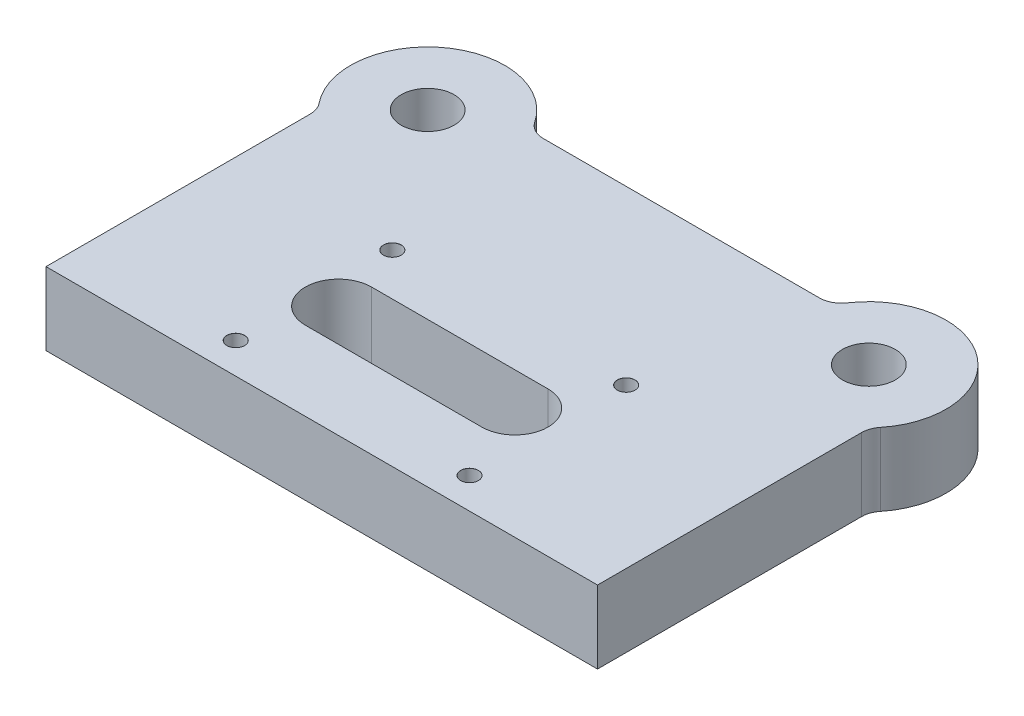
ISO-10303-21;
HEADER;
FILE_DESCRIPTION(('STEP AP214'),'2;1');
FILE_NAME('part.step','',(''),(''),'','','');
FILE_SCHEMA(('AUTOMOTIVE_DESIGN { 1 0 10303 214 1 1 1 1 }'));
ENDSEC;
DATA;
#1=APPLICATION_CONTEXT('core data for automotive mechanical design processes');
#2=APPLICATION_PROTOCOL_DEFINITION('international standard','automotive_design',2000,#1);
#3=PRODUCT_CONTEXT('',#1,'mechanical');
#4=PRODUCT('Part','Part','',(#3));
#5=PRODUCT_RELATED_PRODUCT_CATEGORY('part','',(#4));
#6=PRODUCT_DEFINITION_FORMATION('','',#4);
#7=PRODUCT_DEFINITION_CONTEXT('part definition',#1,'design');
#8=PRODUCT_DEFINITION('design','',#6,#7);
#9=PRODUCT_DEFINITION_SHAPE('','',#8);
#10=(LENGTH_UNIT() NAMED_UNIT(*) SI_UNIT(.MILLI.,.METRE.));
#11=(NAMED_UNIT(*) PLANE_ANGLE_UNIT() SI_UNIT($,.RADIAN.));
#12=(NAMED_UNIT(*) SI_UNIT($,.STERADIAN.) SOLID_ANGLE_UNIT());
#13=UNCERTAINTY_MEASURE_WITH_UNIT(LENGTH_MEASURE(1.E-05),#10,'distance_accuracy_value','');
#14=(GEOMETRIC_REPRESENTATION_CONTEXT(3) GLOBAL_UNCERTAINTY_ASSIGNED_CONTEXT((#13)) GLOBAL_UNIT_ASSIGNED_CONTEXT((#10,
#11,#12)) REPRESENTATION_CONTEXT('',''));
#15=CARTESIAN_POINT('',(0.,0.,0.));
#16=DIRECTION('',(0.,0.,1.));
#17=DIRECTION('',(1.,0.,0.));
#18=AXIS2_PLACEMENT_3D('',#15,#16,#17);
#19=CARTESIAN_POINT('',(-100.,33.,-148.));
#20=DIRECTION('',(0.,1.,0.));
#21=DIRECTION('',(0.,0.,1.));
#22=AXIS2_PLACEMENT_3D('',#19,#20,#21);
#23=PLANE('',#22);
#24=CARTESIAN_POINT('',(-43.2169471824198,33.,-50.7720841198368));
#25=DIRECTION('',(0.,1.,0.));
#26=DIRECTION('',(0.,0.,1.));
#27=AXIS2_PLACEMENT_3D('',#24,#25,#26);
#28=CIRCLE('',#27,15.);
#29=CARTESIAN_POINT('',(-43.2169471824198,33.,-65.7720841198368));
#30=VERTEX_POINT('',#29);
#31=CARTESIAN_POINT('',(-43.2169471824198,33.,-35.7720841198368));
#32=VERTEX_POINT('',#31);
#33=EDGE_CURVE('E48',#30,#32,#28,.T.);
#34=ORIENTED_EDGE('',*,*,#33,.F.);
#35=DIRECTION('',(-1.,0.,0.));
#36=VECTOR('',#35,1.);
#37=CARTESIAN_POINT('',(-43.2169471824198,33.,-65.7720841198368));
#38=LINE('',#37,#36);
#39=CARTESIAN_POINT('',(36.7830528175802,33.,-65.7720841198368));
#40=VERTEX_POINT('',#39);
#41=EDGE_CURVE('E141',#40,#30,#38,.T.);
#42=ORIENTED_EDGE('',*,*,#41,.F.);
#43=CARTESIAN_POINT('',(36.7830528175802,33.,-50.7720841198368));
#44=DIRECTION('',(0.,1.,0.));
#45=DIRECTION('',(0.,0.,1.));
#46=AXIS2_PLACEMENT_3D('',#43,#44,#45);
#47=CIRCLE('',#46,15.);
#48=CARTESIAN_POINT('',(36.7830528175802,33.,-35.7720841198368));
#49=VERTEX_POINT('',#48);
#50=EDGE_CURVE('E161',#49,#40,#47,.T.);
#51=ORIENTED_EDGE('',*,*,#50,.F.);
#52=DIRECTION('',(1.,0.,0.));
#53=VECTOR('',#52,1.);
#54=CARTESIAN_POINT('',(-43.2169471824198,33.,-35.7720841198368));
#55=LINE('',#54,#53);
#56=EDGE_CURVE('E155',#32,#49,#55,.T.);
#57=ORIENTED_EDGE('',*,*,#56,.F.);
#58=EDGE_LOOP('',(#34,#42,#51,#57));
#59=FACE_BOUND('',#58,.T.);
#60=CARTESIAN_POINT('',(-53.,33.,-85.));
#61=DIRECTION('',(0.,1.,0.));
#62=DIRECTION('',(0.,0.,1.));
#63=AXIS2_PLACEMENT_3D('',#60,#61,#62);
#64=CIRCLE('',#63,4.025);
#65=CARTESIAN_POINT('',(-53.,33.,-80.975));
#66=VERTEX_POINT('',#65);
#67=EDGE_CURVE('E147',#66,#66,#64,.T.);
#68=ORIENTED_EDGE('',*,*,#67,.F.);
#69=EDGE_LOOP('',(#68));
#70=FACE_BOUND('',#69,.T.);
#71=CARTESIAN_POINT('',(53.,33.,-85.));
#72=DIRECTION('',(0.,1.,0.));
#73=DIRECTION('',(0.,0.,1.));
#74=AXIS2_PLACEMENT_3D('',#71,#72,#73);
#75=CIRCLE('',#74,4.025);
#76=CARTESIAN_POINT('',(53.,33.,-80.975));
#77=VERTEX_POINT('',#76);
#78=EDGE_CURVE('E178',#77,#77,#75,.T.);
#79=ORIENTED_EDGE('',*,*,#78,.F.);
#80=EDGE_LOOP('',(#79));
#81=FACE_BOUND('',#80,.T.);
#82=CARTESIAN_POINT('',(53.,33.,-14.));
#83=DIRECTION('',(0.,1.,0.));
#84=DIRECTION('',(0.,0.,1.));
#85=AXIS2_PLACEMENT_3D('',#82,#83,#84);
#86=CIRCLE('',#85,4.025);
#87=CARTESIAN_POINT('',(53.,33.,-9.97499999999997));
#88=VERTEX_POINT('',#87);
#89=EDGE_CURVE('E187',#88,#88,#86,.T.);
#90=ORIENTED_EDGE('',*,*,#89,.F.);
#91=EDGE_LOOP('',(#90));
#92=FACE_BOUND('',#91,.T.);
#93=CARTESIAN_POINT('',(-53.,33.,-14.));
#94=DIRECTION('',(0.,1.,0.));
#95=DIRECTION('',(0.,0.,1.));
#96=AXIS2_PLACEMENT_3D('',#93,#94,#95);
#97=CIRCLE('',#96,4.025);
#98=CARTESIAN_POINT('',(-53.,33.,-9.97499999999997));
#99=VERTEX_POINT('',#98);
#100=EDGE_CURVE('E196',#99,#99,#97,.T.);
#101=ORIENTED_EDGE('',*,*,#100,.F.);
#102=EDGE_LOOP('',(#101));
#103=FACE_BOUND('',#102,.T.);
#104=CARTESIAN_POINT('',(-100.,33.,-148.));
#105=DIRECTION('',(0.,1.,0.));
#106=DIRECTION('',(0.,0.,1.));
#107=AXIS2_PLACEMENT_3D('',#104,#105,#106);
#108=CIRCLE('',#107,12.);
#109=CARTESIAN_POINT('',(-100.,33.,-136.));
#110=VERTEX_POINT('',#109);
#111=EDGE_CURVE('E212',#110,#110,#108,.T.);
#112=ORIENTED_EDGE('',*,*,#111,.F.);
#113=EDGE_LOOP('',(#112));
#114=FACE_BOUND('',#113,.T.);
#115=CARTESIAN_POINT('',(-100.,33.,-148.));
#116=DIRECTION('',(0.,1.,0.));
#117=DIRECTION('',(0.,0.,1.));
#118=AXIS2_PLACEMENT_3D('',#115,#116,#117);
#119=CIRCLE('',#118,35.);
#120=CARTESIAN_POINT('',(-70.8982203250916,33.,-167.444444444444));
#121=VERTEX_POINT('',#120);
#122=CARTESIAN_POINT('',(-127.222222222222,33.,-126.001122363085));
#123=VERTEX_POINT('',#122);
#124=EDGE_CURVE('E232',#121,#123,#119,.T.);
#125=ORIENTED_EDGE('',*,*,#124,.T.);
#126=CARTESIAN_POINT('',(-135.,33.,-119.715728752538));
#127=DIRECTION('',(0.,1.,0.));
#128=DIRECTION('',(0.,0.,1.));
#129=AXIS2_PLACEMENT_3D('',#126,#127,#128);
#130=CIRCLE('',#129,10.);
#131=CARTESIAN_POINT('',(-125.,33.,-119.715728752538));
#132=VERTEX_POINT('',#131);
#133=EDGE_CURVE('E11',#123,#132,#130,.F.);
#134=ORIENTED_EDGE('',*,*,#133,.T.);
#135=DIRECTION('',(0.,0.,1.));
#136=VECTOR('',#135,1.);
#137=CARTESIAN_POINT('',(-125.,33.,0.));
#138=LINE('',#137,#136);
#139=CARTESIAN_POINT('',(-125.,33.,0.));
#140=VERTEX_POINT('',#139);
#141=EDGE_CURVE('E218',#132,#140,#138,.T.);
#142=ORIENTED_EDGE('',*,*,#141,.T.);
#143=DIRECTION('',(1.,0.,0.));
#144=VECTOR('',#143,1.);
#145=CARTESIAN_POINT('',(125.,33.,0.));
#146=LINE('',#145,#144);
#147=CARTESIAN_POINT('',(125.,33.,0.));
#148=VERTEX_POINT('',#147);
#149=EDGE_CURVE('E220',#140,#148,#146,.T.);
#150=ORIENTED_EDGE('',*,*,#149,.T.);
#151=DIRECTION('',(0.,0.,-1.));
#152=VECTOR('',#151,1.);
#153=CARTESIAN_POINT('',(125.,33.,0.));
#154=LINE('',#153,#152);
#155=CARTESIAN_POINT('',(125.,33.,-119.715728752538));
#156=VERTEX_POINT('',#155);
#157=EDGE_CURVE('E223',#148,#156,#154,.T.);
#158=ORIENTED_EDGE('',*,*,#157,.T.);
#159=CARTESIAN_POINT('',(135.,33.,-119.715728752538));
#160=DIRECTION('',(0.,1.,0.));
#161=DIRECTION('',(0.,0.,1.));
#162=AXIS2_PLACEMENT_3D('',#159,#160,#161);
#163=CIRCLE('',#162,10.);
#164=CARTESIAN_POINT('',(127.222222222222,33.,-126.001122363085));
#165=VERTEX_POINT('',#164);
#166=EDGE_CURVE('E277',#156,#165,#163,.F.);
#167=ORIENTED_EDGE('',*,*,#166,.T.);
#168=CARTESIAN_POINT('',(100.,33.,-148.));
#169=DIRECTION('',(0.,1.,0.));
#170=DIRECTION('',(0.,0.,-1.));
#171=AXIS2_PLACEMENT_3D('',#168,#169,#170);
#172=CIRCLE('',#171,35.);
#173=CARTESIAN_POINT('',(70.8982203250916,33.,-167.444444444444));
#174=VERTEX_POINT('',#173);
#175=EDGE_CURVE('E226',#165,#174,#172,.T.);
#176=ORIENTED_EDGE('',*,*,#175,.T.);
#177=CARTESIAN_POINT('',(62.5834261322606,33.,-173.));
#178=DIRECTION('',(0.,1.,0.));
#179=DIRECTION('',(0.,0.,1.));
#180=AXIS2_PLACEMENT_3D('',#177,#178,#179);
#181=CIRCLE('',#180,10.);
#182=CARTESIAN_POINT('',(62.5834261322606,33.,-163.));
#183=VERTEX_POINT('',#182);
#184=EDGE_CURVE('E281',#174,#183,#181,.F.);
#185=ORIENTED_EDGE('',*,*,#184,.T.);
#186=DIRECTION('',(-1.,0.,0.));
#187=VECTOR('',#186,1.);
#188=CARTESIAN_POINT('',(68.3772233983162,33.,-163.));
#189=LINE('',#188,#187);
#190=CARTESIAN_POINT('',(-62.5834261322606,33.,-163.));
#191=VERTEX_POINT('',#190);
#192=EDGE_CURVE('E229',#183,#191,#189,.T.);
#193=ORIENTED_EDGE('',*,*,#192,.T.);
#194=CARTESIAN_POINT('',(-62.5834261322606,33.,-173.));
#195=DIRECTION('',(0.,1.,0.));
#196=DIRECTION('',(0.,0.,1.));
#197=AXIS2_PLACEMENT_3D('',#194,#195,#196);
#198=CIRCLE('',#197,10.);
#199=EDGE_CURVE('E285',#191,#121,#198,.F.);
#200=ORIENTED_EDGE('',*,*,#199,.T.);
#201=EDGE_LOOP('',(#125,#134,#142,#150,#158,#167,#176,#185,#193,#200));
#202=FACE_BOUND('',#201,.T.);
#203=CARTESIAN_POINT('',(100.,33.,-148.));
#204=DIRECTION('',(0.,1.,0.));
#205=DIRECTION('',(0.,0.,-1.));
#206=AXIS2_PLACEMENT_3D('',#203,#204,#205);
#207=CIRCLE('',#206,12.);
#208=CARTESIAN_POINT('',(100.,33.,-160.));
#209=VERTEX_POINT('',#208);
#210=EDGE_CURVE('E206',#209,#209,#207,.T.);
#211=ORIENTED_EDGE('',*,*,#210,.F.);
#212=EDGE_LOOP('',(#211));
#213=FACE_BOUND('',#212,.T.);
#214=ADVANCED_FACE('F33',(#59,#70,#81,#92,#103,#114,#202,#213),#23,.T.);
#215=CARTESIAN_POINT('',(-100.,0.,-148.));
#216=DIRECTION('',(0.,1.,0.));
#217=DIRECTION('',(0.,0.,1.));
#218=AXIS2_PLACEMENT_3D('',#215,#216,#217);
#219=PLANE('',#218);
#220=DIRECTION('',(1.,0.,0.));
#221=VECTOR('',#220,1.);
#222=CARTESIAN_POINT('',(-43.2169471824198,0.,-65.7720841198368));
#223=LINE('',#222,#221);
#224=CARTESIAN_POINT('',(-43.2169471824198,0.,-65.7720841198368));
#225=VERTEX_POINT('',#224);
#226=CARTESIAN_POINT('',(36.7830528175802,0.,-65.7720841198368));
#227=VERTEX_POINT('',#226);
#228=EDGE_CURVE('E153',#225,#227,#223,.T.);
#229=ORIENTED_EDGE('',*,*,#228,.F.);
#230=CARTESIAN_POINT('',(-43.2169471824198,0.,-50.7720841198368));
#231=DIRECTION('',(0.,1.,0.));
#232=DIRECTION('',(0.,0.,1.));
#233=AXIS2_PLACEMENT_3D('',#230,#231,#232);
#234=CIRCLE('',#233,15.);
#235=CARTESIAN_POINT('',(-43.2169471824198,0.,-35.7720841198368));
#236=VERTEX_POINT('',#235);
#237=EDGE_CURVE('E135',#236,#225,#234,.F.);
#238=ORIENTED_EDGE('',*,*,#237,.F.);
#239=DIRECTION('',(-1.,0.,0.));
#240=VECTOR('',#239,1.);
#241=CARTESIAN_POINT('',(-43.2169471824198,0.,-35.7720841198368));
#242=LINE('',#241,#240);
#243=CARTESIAN_POINT('',(36.7830528175802,0.,-35.7720841198368));
#244=VERTEX_POINT('',#243);
#245=EDGE_CURVE('E144',#244,#236,#242,.T.);
#246=ORIENTED_EDGE('',*,*,#245,.F.);
#247=CARTESIAN_POINT('',(36.7830528175802,0.,-50.7720841198368));
#248=DIRECTION('',(0.,1.,0.));
#249=DIRECTION('',(0.,0.,1.));
#250=AXIS2_PLACEMENT_3D('',#247,#248,#249);
#251=CIRCLE('',#250,15.);
#252=EDGE_CURVE('E56',#227,#244,#251,.F.);
#253=ORIENTED_EDGE('',*,*,#252,.F.);
#254=EDGE_LOOP('',(#229,#238,#246,#253));
#255=FACE_BOUND('',#254,.T.);
#256=CARTESIAN_POINT('',(-53.,0.,-85.));
#257=DIRECTION('',(0.,1.,0.));
#258=DIRECTION('',(0.,0.,1.));
#259=AXIS2_PLACEMENT_3D('',#256,#257,#258);
#260=CIRCLE('',#259,3.99999999999999);
#261=CARTESIAN_POINT('',(-53.,0.,-81.));
#262=VERTEX_POINT('',#261);
#263=EDGE_CURVE('E175',#262,#262,#260,.T.);
#264=ORIENTED_EDGE('',*,*,#263,.T.);
#265=EDGE_LOOP('',(#264));
#266=FACE_BOUND('',#265,.T.);
#267=CARTESIAN_POINT('',(53.,0.,-85.));
#268=DIRECTION('',(0.,1.,0.));
#269=DIRECTION('',(0.,0.,1.));
#270=AXIS2_PLACEMENT_3D('',#267,#268,#269);
#271=CIRCLE('',#270,3.99999999999999);
#272=CARTESIAN_POINT('',(53.,0.,-81.));
#273=VERTEX_POINT('',#272);
#274=EDGE_CURVE('E184',#273,#273,#271,.T.);
#275=ORIENTED_EDGE('',*,*,#274,.T.);
#276=EDGE_LOOP('',(#275));
#277=FACE_BOUND('',#276,.T.);
#278=CARTESIAN_POINT('',(53.,0.,-14.));
#279=DIRECTION('',(0.,1.,0.));
#280=DIRECTION('',(0.,0.,1.));
#281=AXIS2_PLACEMENT_3D('',#278,#279,#280);
#282=CIRCLE('',#281,3.99999999999999);
#283=CARTESIAN_POINT('',(53.,0.,-9.99999999999998));
#284=VERTEX_POINT('',#283);
#285=EDGE_CURVE('E193',#284,#284,#282,.T.);
#286=ORIENTED_EDGE('',*,*,#285,.T.);
#287=EDGE_LOOP('',(#286));
#288=FACE_BOUND('',#287,.T.);
#289=CARTESIAN_POINT('',(-53.,0.,-14.));
#290=DIRECTION('',(0.,1.,0.));
#291=DIRECTION('',(0.,0.,1.));
#292=AXIS2_PLACEMENT_3D('',#289,#290,#291);
#293=CIRCLE('',#292,3.99999999999999);
#294=CARTESIAN_POINT('',(-53.,0.,-9.99999999999998));
#295=VERTEX_POINT('',#294);
#296=EDGE_CURVE('E202',#295,#295,#293,.T.);
#297=ORIENTED_EDGE('',*,*,#296,.T.);
#298=EDGE_LOOP('',(#297));
#299=FACE_BOUND('',#298,.T.);
#300=DIRECTION('',(0.,0.,1.));
#301=VECTOR('',#300,1.);
#302=CARTESIAN_POINT('',(-125.,0.,0.));
#303=LINE('',#302,#301);
#304=CARTESIAN_POINT('',(-125.,0.,-119.715728752538));
#305=VERTEX_POINT('',#304);
#306=CARTESIAN_POINT('',(-125.,0.,0.));
#307=VERTEX_POINT('',#306);
#308=EDGE_CURVE('E215',#305,#307,#303,.T.);
#309=ORIENTED_EDGE('',*,*,#308,.F.);
#310=CARTESIAN_POINT('',(-135.,0.,-119.715728752538));
#311=DIRECTION('',(0.,1.,0.));
#312=DIRECTION('',(0.,0.,1.));
#313=AXIS2_PLACEMENT_3D('',#310,#311,#312);
#314=CIRCLE('',#313,10.);
#315=CARTESIAN_POINT('',(-127.222222222222,0.,-126.001122363085));
#316=VERTEX_POINT('',#315);
#317=EDGE_CURVE('E41',#305,#316,#314,.T.);
#318=ORIENTED_EDGE('',*,*,#317,.T.);
#319=CARTESIAN_POINT('',(-100.,0.,-148.));
#320=DIRECTION('',(0.,1.,0.));
#321=DIRECTION('',(0.,0.,1.));
#322=AXIS2_PLACEMENT_3D('',#319,#320,#321);
#323=CIRCLE('',#322,35.);
#324=CARTESIAN_POINT('',(-70.8982203250916,0.,-167.444444444444));
#325=VERTEX_POINT('',#324);
#326=EDGE_CURVE('E221',#325,#316,#323,.T.);
#327=ORIENTED_EDGE('',*,*,#326,.F.);
#328=CARTESIAN_POINT('',(-62.5834261322606,0.,-173.));
#329=DIRECTION('',(0.,1.,0.));
#330=DIRECTION('',(0.,0.,1.));
#331=AXIS2_PLACEMENT_3D('',#328,#329,#330);
#332=CIRCLE('',#331,10.);
#333=CARTESIAN_POINT('',(-62.5834261322606,0.,-163.));
#334=VERTEX_POINT('',#333);
#335=EDGE_CURVE('E283',#325,#334,#332,.T.);
#336=ORIENTED_EDGE('',*,*,#335,.T.);
#337=DIRECTION('',(-1.,0.,0.));
#338=VECTOR('',#337,1.);
#339=CARTESIAN_POINT('',(68.3772233983162,0.,-163.));
#340=LINE('',#339,#338);
#341=CARTESIAN_POINT('',(62.5834261322606,0.,-163.));
#342=VERTEX_POINT('',#341);
#343=EDGE_CURVE('E245',#342,#334,#340,.T.);
#344=ORIENTED_EDGE('',*,*,#343,.F.);
#345=CARTESIAN_POINT('',(62.5834261322606,0.,-173.));
#346=DIRECTION('',(0.,1.,0.));
#347=DIRECTION('',(0.,0.,1.));
#348=AXIS2_PLACEMENT_3D('',#345,#346,#347);
#349=CIRCLE('',#348,10.);
#350=CARTESIAN_POINT('',(70.8982203250916,0.,-167.444444444444));
#351=VERTEX_POINT('',#350);
#352=EDGE_CURVE('E279',#342,#351,#349,.T.);
#353=ORIENTED_EDGE('',*,*,#352,.T.);
#354=CARTESIAN_POINT('',(100.,0.,-148.));
#355=DIRECTION('',(0.,1.,0.));
#356=DIRECTION('',(0.,0.,-1.));
#357=AXIS2_PLACEMENT_3D('',#354,#355,#356);
#358=CIRCLE('',#357,35.);
#359=CARTESIAN_POINT('',(127.222222222222,0.,-126.001122363085));
#360=VERTEX_POINT('',#359);
#361=EDGE_CURVE('E242',#360,#351,#358,.T.);
#362=ORIENTED_EDGE('',*,*,#361,.F.);
#363=CARTESIAN_POINT('',(135.,0.,-119.715728752538));
#364=DIRECTION('',(0.,1.,0.));
#365=DIRECTION('',(0.,0.,1.));
#366=AXIS2_PLACEMENT_3D('',#363,#364,#365);
#367=CIRCLE('',#366,10.);
#368=CARTESIAN_POINT('',(125.,0.,-119.715728752538));
#369=VERTEX_POINT('',#368);
#370=EDGE_CURVE('E275',#360,#369,#367,.T.);
#371=ORIENTED_EDGE('',*,*,#370,.T.);
#372=DIRECTION('',(0.,0.,-1.));
#373=VECTOR('',#372,1.);
#374=CARTESIAN_POINT('',(125.,0.,0.));
#375=LINE('',#374,#373);
#376=CARTESIAN_POINT('',(125.,0.,0.));
#377=VERTEX_POINT('',#376);
#378=EDGE_CURVE('E239',#377,#369,#375,.T.);
#379=ORIENTED_EDGE('',*,*,#378,.F.);
#380=DIRECTION('',(1.,0.,0.));
#381=VECTOR('',#380,1.);
#382=CARTESIAN_POINT('',(125.,0.,0.));
#383=LINE('',#382,#381);
#384=EDGE_CURVE('E237',#307,#377,#383,.T.);
#385=ORIENTED_EDGE('',*,*,#384,.F.);
#386=EDGE_LOOP('',(#309,#318,#327,#336,#344,#353,#362,#371,#379,#385));
#387=FACE_BOUND('',#386,.T.);
#388=CARTESIAN_POINT('',(-100.,0.,-148.));
#389=DIRECTION('',(0.,1.,0.));
#390=DIRECTION('',(0.,0.,1.));
#391=AXIS2_PLACEMENT_3D('',#388,#389,#390);
#392=CIRCLE('',#391,12.);
#393=CARTESIAN_POINT('',(-100.,0.,-136.));
#394=VERTEX_POINT('',#393);
#395=EDGE_CURVE('E209',#394,#394,#392,.T.);
#396=ORIENTED_EDGE('',*,*,#395,.T.);
#397=EDGE_LOOP('',(#396));
#398=FACE_BOUND('',#397,.T.);
#399=CARTESIAN_POINT('',(100.,0.,-148.));
#400=DIRECTION('',(0.,1.,0.));
#401=DIRECTION('',(0.,0.,-1.));
#402=AXIS2_PLACEMENT_3D('',#399,#400,#401);
#403=CIRCLE('',#402,12.);
#404=CARTESIAN_POINT('',(100.,0.,-160.));
#405=VERTEX_POINT('',#404);
#406=EDGE_CURVE('E205',#405,#405,#403,.T.);
#407=ORIENTED_EDGE('',*,*,#406,.T.);
#408=EDGE_LOOP('',(#407));
#409=FACE_BOUND('',#408,.T.);
#410=ADVANCED_FACE('F150',(#255,#266,#277,#288,#299,#387,#398,#409),#219,.F.);
#411=CARTESIAN_POINT('',(-125.,33.,0.));
#412=DIRECTION('',(1.,0.,0.));
#413=DIRECTION('',(0.,0.,-1.));
#414=AXIS2_PLACEMENT_3D('',#411,#412,#413);
#415=PLANE('',#414);
#416=ORIENTED_EDGE('',*,*,#141,.F.);
#417=DIRECTION('',(0.,1.,0.));
#418=VECTOR('',#417,1.);
#419=CARTESIAN_POINT('',(-125.,0.,-119.715728752538));
#420=LINE('',#419,#418);
#421=EDGE_CURVE('E272',#132,#305,#420,.F.);
#422=ORIENTED_EDGE('',*,*,#421,.T.);
#423=ORIENTED_EDGE('',*,*,#308,.T.);
#424=DIRECTION('',(0.,-1.,0.));
#425=VECTOR('',#424,1.);
#426=CARTESIAN_POINT('',(-125.,33.,0.));
#427=LINE('',#426,#425);
#428=EDGE_CURVE('E252',#140,#307,#427,.T.);
#429=ORIENTED_EDGE('',*,*,#428,.F.);
#430=EDGE_LOOP('',(#416,#422,#423,#429));
#431=FACE_BOUND('',#430,.T.);
#432=ADVANCED_FACE('F305',(#431),#415,.F.);
#433=CARTESIAN_POINT('',(125.,33.,0.));
#434=DIRECTION('',(0.,0.,-1.));
#435=DIRECTION('',(-1.,0.,0.));
#436=AXIS2_PLACEMENT_3D('',#433,#434,#435);
#437=PLANE('',#436);
#438=ORIENTED_EDGE('',*,*,#384,.T.);
#439=DIRECTION('',(0.,-1.,0.));
#440=VECTOR('',#439,1.);
#441=CARTESIAN_POINT('',(125.,33.,0.));
#442=LINE('',#441,#440);
#443=EDGE_CURVE('E235',#148,#377,#442,.T.);
#444=ORIENTED_EDGE('',*,*,#443,.F.);
#445=ORIENTED_EDGE('',*,*,#149,.F.);
#446=ORIENTED_EDGE('',*,*,#428,.T.);
#447=EDGE_LOOP('',(#438,#444,#445,#446));
#448=FACE_BOUND('',#447,.T.);
#449=ADVANCED_FACE('F307',(#448),#437,.F.);
#450=CARTESIAN_POINT('',(125.,33.,0.));
#451=DIRECTION('',(-1.,0.,0.));
#452=DIRECTION('',(0.,0.,1.));
#453=AXIS2_PLACEMENT_3D('',#450,#451,#452);
#454=PLANE('',#453);
#455=ORIENTED_EDGE('',*,*,#378,.T.);
#456=DIRECTION('',(0.,1.,0.));
#457=VECTOR('',#456,1.);
#458=CARTESIAN_POINT('',(125.,33.,-119.715728752538));
#459=LINE('',#458,#457);
#460=EDGE_CURVE('E260',#369,#156,#459,.T.);
#461=ORIENTED_EDGE('',*,*,#460,.T.);
#462=ORIENTED_EDGE('',*,*,#157,.F.);
#463=ORIENTED_EDGE('',*,*,#443,.T.);
#464=EDGE_LOOP('',(#455,#461,#462,#463));
#465=FACE_BOUND('',#464,.T.);
#466=ADVANCED_FACE('F359',(#465),#454,.F.);
#467=CARTESIAN_POINT('',(100.,33.,-148.));
#468=DIRECTION('',(0.,-1.,0.));
#469=DIRECTION('',(0.,0.,-1.));
#470=AXIS2_PLACEMENT_3D('',#467,#468,#469);
#471=CYLINDRICAL_SURFACE('',#470,35.);
#472=ORIENTED_EDGE('',*,*,#175,.F.);
#473=DIRECTION('',(0.,-1.,0.));
#474=VECTOR('',#473,1.);
#475=CARTESIAN_POINT('',(127.222222222222,33.,-126.001122363085));
#476=LINE('',#475,#474);
#477=EDGE_CURVE('E257',#165,#360,#476,.T.);
#478=ORIENTED_EDGE('',*,*,#477,.T.);
#479=ORIENTED_EDGE('',*,*,#361,.T.);
#480=DIRECTION('',(0.,-1.,0.));
#481=VECTOR('',#480,1.);
#482=CARTESIAN_POINT('',(70.8982203250916,33.,-167.444444444444));
#483=LINE('',#482,#481);
#484=EDGE_CURVE('E255',#351,#174,#483,.F.);
#485=ORIENTED_EDGE('',*,*,#484,.T.);
#486=EDGE_LOOP('',(#472,#478,#479,#485));
#487=FACE_BOUND('',#486,.T.);
#488=ADVANCED_FACE('F319',(#487),#471,.T.);
#489=CARTESIAN_POINT('',(68.3772233983162,33.,-163.));
#490=DIRECTION('',(0.,0.,1.));
#491=DIRECTION('',(1.,0.,0.));
#492=AXIS2_PLACEMENT_3D('',#489,#490,#491);
#493=PLANE('',#492);
#494=ORIENTED_EDGE('',*,*,#192,.F.);
#495=DIRECTION('',(0.,1.,0.));
#496=VECTOR('',#495,1.);
#497=CARTESIAN_POINT('',(62.5834261322606,0.,-163.));
#498=LINE('',#497,#496);
#499=EDGE_CURVE('E264',#183,#342,#498,.F.);
#500=ORIENTED_EDGE('',*,*,#499,.T.);
#501=ORIENTED_EDGE('',*,*,#343,.T.);
#502=DIRECTION('',(0.,1.,0.));
#503=VECTOR('',#502,1.);
#504=CARTESIAN_POINT('',(-62.5834261322606,33.,-163.));
#505=LINE('',#504,#503);
#506=EDGE_CURVE('E262',#334,#191,#505,.T.);
#507=ORIENTED_EDGE('',*,*,#506,.T.);
#508=EDGE_LOOP('',(#494,#500,#501,#507));
#509=FACE_BOUND('',#508,.T.);
#510=ADVANCED_FACE('F329',(#509),#493,.F.);
#511=CARTESIAN_POINT('',(-100.,33.,-148.));
#512=DIRECTION('',(0.,-1.,0.));
#513=DIRECTION('',(0.,0.,-1.));
#514=AXIS2_PLACEMENT_3D('',#511,#512,#513);
#515=CYLINDRICAL_SURFACE('',#514,35.);
#516=ORIENTED_EDGE('',*,*,#124,.F.);
#517=DIRECTION('',(0.,-1.,0.));
#518=VECTOR('',#517,1.);
#519=CARTESIAN_POINT('',(-70.8982203250916,33.,-167.444444444444));
#520=LINE('',#519,#518);
#521=EDGE_CURVE('E269',#121,#325,#520,.T.);
#522=ORIENTED_EDGE('',*,*,#521,.T.);
#523=ORIENTED_EDGE('',*,*,#326,.T.);
#524=DIRECTION('',(0.,-1.,0.));
#525=VECTOR('',#524,1.);
#526=CARTESIAN_POINT('',(-127.222222222222,33.,-126.001122363085));
#527=LINE('',#526,#525);
#528=EDGE_CURVE('E267',#316,#123,#527,.F.);
#529=ORIENTED_EDGE('',*,*,#528,.T.);
#530=EDGE_LOOP('',(#516,#522,#523,#529));
#531=FACE_BOUND('',#530,.T.);
#532=ADVANCED_FACE('F296',(#531),#515,.T.);
#533=CARTESIAN_POINT('',(-100.,33.,-148.));
#534=DIRECTION('',(0.,-1.,0.));
#535=DIRECTION('',(0.,0.,-1.));
#536=AXIS2_PLACEMENT_3D('',#533,#534,#535);
#537=CYLINDRICAL_SURFACE('',#536,12.);
#538=ORIENTED_EDGE('',*,*,#111,.T.);
#539=EDGE_LOOP('',(#538));
#540=FACE_BOUND('',#539,.T.);
#541=ORIENTED_EDGE('',*,*,#395,.F.);
#542=EDGE_LOOP('',(#541));
#543=FACE_BOUND('',#542,.T.);
#544=ADVANCED_FACE('F350',(#540,#543),#537,.F.);
#545=CARTESIAN_POINT('',(100.,33.,-148.));
#546=DIRECTION('',(0.,-1.,0.));
#547=DIRECTION('',(0.,0.,-1.));
#548=AXIS2_PLACEMENT_3D('',#545,#546,#547);
#549=CYLINDRICAL_SURFACE('',#548,12.);
#550=ORIENTED_EDGE('',*,*,#210,.T.);
#551=EDGE_LOOP('',(#550));
#552=FACE_BOUND('',#551,.T.);
#553=ORIENTED_EDGE('',*,*,#406,.F.);
#554=EDGE_LOOP('',(#553));
#555=FACE_BOUND('',#554,.T.);
#556=ADVANCED_FACE('F367',(#552,#555),#549,.F.);
#557=CARTESIAN_POINT('',(135.,33.,-119.715728752538));
#558=DIRECTION('',(0.,-1.,0.));
#559=DIRECTION('',(0.,0.,-1.));
#560=AXIS2_PLACEMENT_3D('',#557,#558,#559);
#561=CYLINDRICAL_SURFACE('',#560,10.);
#562=ORIENTED_EDGE('',*,*,#166,.F.);
#563=ORIENTED_EDGE('',*,*,#460,.F.);
#564=ORIENTED_EDGE('',*,*,#370,.F.);
#565=ORIENTED_EDGE('',*,*,#477,.F.);
#566=EDGE_LOOP('',(#562,#563,#564,#565));
#567=FACE_BOUND('',#566,.T.);
#568=ADVANCED_FACE('F316',(#567),#561,.F.);
#569=CARTESIAN_POINT('',(62.5834261322606,33.,-173.));
#570=DIRECTION('',(0.,-1.,0.));
#571=DIRECTION('',(0.,0.,-1.));
#572=AXIS2_PLACEMENT_3D('',#569,#570,#571);
#573=CYLINDRICAL_SURFACE('',#572,10.);
#574=ORIENTED_EDGE('',*,*,#184,.F.);
#575=ORIENTED_EDGE('',*,*,#484,.F.);
#576=ORIENTED_EDGE('',*,*,#352,.F.);
#577=ORIENTED_EDGE('',*,*,#499,.F.);
#578=EDGE_LOOP('',(#574,#575,#576,#577));
#579=FACE_BOUND('',#578,.T.);
#580=ADVANCED_FACE('F326',(#579),#573,.F.);
#581=CARTESIAN_POINT('',(-62.5834261322606,33.,-173.));
#582=DIRECTION('',(0.,-1.,0.));
#583=DIRECTION('',(0.,0.,-1.));
#584=AXIS2_PLACEMENT_3D('',#581,#582,#583);
#585=CYLINDRICAL_SURFACE('',#584,10.);
#586=ORIENTED_EDGE('',*,*,#199,.F.);
#587=ORIENTED_EDGE('',*,*,#506,.F.);
#588=ORIENTED_EDGE('',*,*,#335,.F.);
#589=ORIENTED_EDGE('',*,*,#521,.F.);
#590=EDGE_LOOP('',(#586,#587,#588,#589));
#591=FACE_BOUND('',#590,.T.);
#592=ADVANCED_FACE('F333',(#591),#585,.F.);
#593=CARTESIAN_POINT('',(-135.,33.,-119.715728752538));
#594=DIRECTION('',(0.,-1.,0.));
#595=DIRECTION('',(0.,0.,-1.));
#596=AXIS2_PLACEMENT_3D('',#593,#594,#595);
#597=CYLINDRICAL_SURFACE('',#596,10.);
#598=ORIENTED_EDGE('',*,*,#133,.F.);
#599=ORIENTED_EDGE('',*,*,#528,.F.);
#600=ORIENTED_EDGE('',*,*,#317,.F.);
#601=ORIENTED_EDGE('',*,*,#421,.F.);
#602=EDGE_LOOP('',(#598,#599,#600,#601));
#603=FACE_BOUND('',#602,.T.);
#604=ADVANCED_FACE('F35',(#603),#597,.F.);
#605=CARTESIAN_POINT('',(-53.,33.,-14.));
#606=DIRECTION('',(0.,1.,0.));
#607=DIRECTION('',(0.,0.,1.));
#608=AXIS2_PLACEMENT_3D('',#605,#606,#607);
#609=CYLINDRICAL_SURFACE('',#608,3.99999999999999);
#610=ORIENTED_EDGE('',*,*,#296,.F.);
#611=EDGE_LOOP('',(#610));
#612=FACE_BOUND('',#611,.T.);
#613=CARTESIAN_POINT('',(-53.,32.975,-14.));
#614=DIRECTION('',(0.,1.,0.));
#615=DIRECTION('',(0.,0.,1.));
#616=AXIS2_PLACEMENT_3D('',#613,#614,#615);
#617=CIRCLE('',#616,4.);
#618=CARTESIAN_POINT('',(-53.,32.975,-9.99999999999997));
#619=VERTEX_POINT('',#618);
#620=EDGE_CURVE('E199',#619,#619,#617,.T.);
#621=ORIENTED_EDGE('',*,*,#620,.T.);
#622=EDGE_LOOP('',(#621));
#623=FACE_BOUND('',#622,.T.);
#624=ADVANCED_FACE('F339',(#612,#623),#609,.F.);
#625=CARTESIAN_POINT('',(-53.,33.,-14.));
#626=DIRECTION('',(0.,1.,0.));
#627=DIRECTION('',(0.,0.,1.));
#628=AXIS2_PLACEMENT_3D('',#625,#626,#627);
#629=CONICAL_SURFACE('',#628,4.025,0.785398163397587);
#630=ORIENTED_EDGE('',*,*,#620,.F.);
#631=EDGE_LOOP('',(#630));
#632=FACE_BOUND('',#631,.T.);
#633=ORIENTED_EDGE('',*,*,#100,.T.);
#634=EDGE_LOOP('',(#633));
#635=FACE_BOUND('',#634,.T.);
#636=ADVANCED_FACE('F380',(#632,#635),#629,.F.);
#637=CARTESIAN_POINT('',(53.,33.,-14.));
#638=DIRECTION('',(0.,1.,0.));
#639=DIRECTION('',(0.,0.,1.));
#640=AXIS2_PLACEMENT_3D('',#637,#638,#639);
#641=CYLINDRICAL_SURFACE('',#640,3.99999999999999);
#642=ORIENTED_EDGE('',*,*,#285,.F.);
#643=EDGE_LOOP('',(#642));
#644=FACE_BOUND('',#643,.T.);
#645=CARTESIAN_POINT('',(53.,32.975,-14.));
#646=DIRECTION('',(0.,1.,0.));
#647=DIRECTION('',(0.,0.,1.));
#648=AXIS2_PLACEMENT_3D('',#645,#646,#647);
#649=CIRCLE('',#648,4.);
#650=CARTESIAN_POINT('',(53.,32.975,-9.99999999999997));
#651=VERTEX_POINT('',#650);
#652=EDGE_CURVE('E190',#651,#651,#649,.T.);
#653=ORIENTED_EDGE('',*,*,#652,.T.);
#654=EDGE_LOOP('',(#653));
#655=FACE_BOUND('',#654,.T.);
#656=ADVANCED_FACE('F384',(#644,#655),#641,.F.);
#657=CARTESIAN_POINT('',(53.,33.,-14.));
#658=DIRECTION('',(0.,1.,0.));
#659=DIRECTION('',(0.,0.,1.));
#660=AXIS2_PLACEMENT_3D('',#657,#658,#659);
#661=CONICAL_SURFACE('',#660,4.025,0.785398163397587);
#662=ORIENTED_EDGE('',*,*,#652,.F.);
#663=EDGE_LOOP('',(#662));
#664=FACE_BOUND('',#663,.T.);
#665=ORIENTED_EDGE('',*,*,#89,.T.);
#666=EDGE_LOOP('',(#665));
#667=FACE_BOUND('',#666,.T.);
#668=ADVANCED_FACE('F388',(#664,#667),#661,.F.);
#669=CARTESIAN_POINT('',(53.,33.,-85.));
#670=DIRECTION('',(0.,1.,0.));
#671=DIRECTION('',(0.,0.,1.));
#672=AXIS2_PLACEMENT_3D('',#669,#670,#671);
#673=CYLINDRICAL_SURFACE('',#672,3.99999999999999);
#674=ORIENTED_EDGE('',*,*,#274,.F.);
#675=EDGE_LOOP('',(#674));
#676=FACE_BOUND('',#675,.T.);
#677=CARTESIAN_POINT('',(53.,32.975,-85.));
#678=DIRECTION('',(0.,1.,0.));
#679=DIRECTION('',(0.,0.,1.));
#680=AXIS2_PLACEMENT_3D('',#677,#678,#679);
#681=CIRCLE('',#680,4.);
#682=CARTESIAN_POINT('',(53.,32.975,-81.));
#683=VERTEX_POINT('',#682);
#684=EDGE_CURVE('E181',#683,#683,#681,.T.);
#685=ORIENTED_EDGE('',*,*,#684,.T.);
#686=EDGE_LOOP('',(#685));
#687=FACE_BOUND('',#686,.T.);
#688=ADVANCED_FACE('F392',(#676,#687),#673,.F.);
#689=CARTESIAN_POINT('',(53.,33.,-85.));
#690=DIRECTION('',(0.,1.,0.));
#691=DIRECTION('',(0.,0.,1.));
#692=AXIS2_PLACEMENT_3D('',#689,#690,#691);
#693=CONICAL_SURFACE('',#692,4.025,0.785398163397587);
#694=ORIENTED_EDGE('',*,*,#684,.F.);
#695=EDGE_LOOP('',(#694));
#696=FACE_BOUND('',#695,.T.);
#697=ORIENTED_EDGE('',*,*,#78,.T.);
#698=EDGE_LOOP('',(#697));
#699=FACE_BOUND('',#698,.T.);
#700=ADVANCED_FACE('F396',(#696,#699),#693,.F.);
#701=CARTESIAN_POINT('',(-53.,33.,-85.));
#702=DIRECTION('',(0.,1.,0.));
#703=DIRECTION('',(0.,0.,1.));
#704=AXIS2_PLACEMENT_3D('',#701,#702,#703);
#705=CYLINDRICAL_SURFACE('',#704,3.99999999999999);
#706=ORIENTED_EDGE('',*,*,#263,.F.);
#707=EDGE_LOOP('',(#706));
#708=FACE_BOUND('',#707,.T.);
#709=CARTESIAN_POINT('',(-53.,32.975,-85.));
#710=DIRECTION('',(0.,1.,0.));
#711=DIRECTION('',(0.,0.,1.));
#712=AXIS2_PLACEMENT_3D('',#709,#710,#711);
#713=CIRCLE('',#712,4.);
#714=CARTESIAN_POINT('',(-53.,32.975,-81.));
#715=VERTEX_POINT('',#714);
#716=EDGE_CURVE('E172',#715,#715,#713,.T.);
#717=ORIENTED_EDGE('',*,*,#716,.T.);
#718=EDGE_LOOP('',(#717));
#719=FACE_BOUND('',#718,.T.);
#720=ADVANCED_FACE('F400',(#708,#719),#705,.F.);
#721=CARTESIAN_POINT('',(-53.,33.,-85.));
#722=DIRECTION('',(0.,1.,0.));
#723=DIRECTION('',(0.,0.,1.));
#724=AXIS2_PLACEMENT_3D('',#721,#722,#723);
#725=CONICAL_SURFACE('',#724,4.025,0.785398163397587);
#726=ORIENTED_EDGE('',*,*,#716,.F.);
#727=EDGE_LOOP('',(#726));
#728=FACE_BOUND('',#727,.T.);
#729=ORIENTED_EDGE('',*,*,#67,.T.);
#730=EDGE_LOOP('',(#729));
#731=FACE_BOUND('',#730,.T.);
#732=ADVANCED_FACE('F404',(#728,#731),#725,.F.);
#733=CARTESIAN_POINT('',(-43.2169471824198,-0.001000000000001,-50.7720841198368));
#734=DIRECTION('',(0.,1.,0.));
#735=DIRECTION('',(0.,0.,1.));
#736=AXIS2_PLACEMENT_3D('',#733,#734,#735);
#737=CYLINDRICAL_SURFACE('',#736,15.);
#738=ORIENTED_EDGE('',*,*,#237,.T.);
#739=DIRECTION('',(0.,1.,0.));
#740=VECTOR('',#739,1.);
#741=CARTESIAN_POINT('',(-43.2169471824198,-0.001000000000001,-65.7720841198368));
#742=LINE('',#741,#740);
#743=EDGE_CURVE('E148',#225,#30,#742,.T.);
#744=ORIENTED_EDGE('',*,*,#743,.T.);
#745=ORIENTED_EDGE('',*,*,#33,.T.);
#746=DIRECTION('',(0.,1.,0.));
#747=VECTOR('',#746,1.);
#748=CARTESIAN_POINT('',(-43.2169471824198,-0.001000000000001,-35.7720841198368));
#749=LINE('',#748,#747);
#750=EDGE_CURVE('E131',#236,#32,#749,.T.);
#751=ORIENTED_EDGE('',*,*,#750,.F.);
#752=EDGE_LOOP('',(#738,#744,#745,#751));
#753=FACE_BOUND('',#752,.T.);
#754=ADVANCED_FACE('F133',(#753),#737,.F.);
#755=CARTESIAN_POINT('',(-43.2169471824198,-0.001000000000001,-65.7720841198368));
#756=DIRECTION('',(0.,0.,-1.));
#757=DIRECTION('',(-1.,0.,0.));
#758=AXIS2_PLACEMENT_3D('',#755,#756,#757);
#759=PLANE('',#758);
#760=ORIENTED_EDGE('',*,*,#228,.T.);
#761=DIRECTION('',(0.,1.,0.));
#762=VECTOR('',#761,1.);
#763=CARTESIAN_POINT('',(36.7830528175802,-0.001000000000001,-65.7720841198368));
#764=LINE('',#763,#762);
#765=EDGE_CURVE('E167',#227,#40,#764,.T.);
#766=ORIENTED_EDGE('',*,*,#765,.T.);
#767=ORIENTED_EDGE('',*,*,#41,.T.);
#768=ORIENTED_EDGE('',*,*,#743,.F.);
#769=EDGE_LOOP('',(#760,#766,#767,#768));
#770=FACE_BOUND('',#769,.T.);
#771=ADVANCED_FACE('F411',(#770),#759,.F.);
#772=CARTESIAN_POINT('',(36.7830528175802,-0.001000000000001,-50.7720841198368));
#773=DIRECTION('',(0.,1.,0.));
#774=DIRECTION('',(0.,0.,1.));
#775=AXIS2_PLACEMENT_3D('',#772,#773,#774);
#776=CYLINDRICAL_SURFACE('',#775,15.);
#777=ORIENTED_EDGE('',*,*,#252,.T.);
#778=DIRECTION('',(0.,1.,0.));
#779=VECTOR('',#778,1.);
#780=CARTESIAN_POINT('',(36.7830528175802,-0.001000000000001,-35.7720841198368));
#781=LINE('',#780,#779);
#782=EDGE_CURVE('E140',#244,#49,#781,.T.);
#783=ORIENTED_EDGE('',*,*,#782,.T.);
#784=ORIENTED_EDGE('',*,*,#50,.T.);
#785=ORIENTED_EDGE('',*,*,#765,.F.);
#786=EDGE_LOOP('',(#777,#783,#784,#785));
#787=FACE_BOUND('',#786,.T.);
#788=ADVANCED_FACE('F414',(#787),#776,.F.);
#789=CARTESIAN_POINT('',(-43.2169471824198,-0.001000000000001,-35.7720841198368));
#790=DIRECTION('',(0.,0.,1.));
#791=DIRECTION('',(1.,0.,0.));
#792=AXIS2_PLACEMENT_3D('',#789,#790,#791);
#793=PLANE('',#792);
#794=ORIENTED_EDGE('',*,*,#245,.T.);
#795=ORIENTED_EDGE('',*,*,#750,.T.);
#796=ORIENTED_EDGE('',*,*,#56,.T.);
#797=ORIENTED_EDGE('',*,*,#782,.F.);
#798=EDGE_LOOP('',(#794,#795,#796,#797));
#799=FACE_BOUND('',#798,.T.);
#800=ADVANCED_FACE('F145',(#799),#793,.F.);
#801=CLOSED_SHELL('',(#214,#410,#432,#449,#466,#488,#510,#532,#544,#556,#568,#580,#592,#604,
#624,#636,#656,#668,#688,#700,#720,#732,#754,#771,#788,#800));
#802=MANIFOLD_SOLID_BREP('B2',#801);
#803=ADVANCED_BREP_SHAPE_REPRESENTATION('',(#18,#802),#14);
#804=SHAPE_DEFINITION_REPRESENTATION(#9,#803);
ENDSEC;
END-ISO-10303-21;
